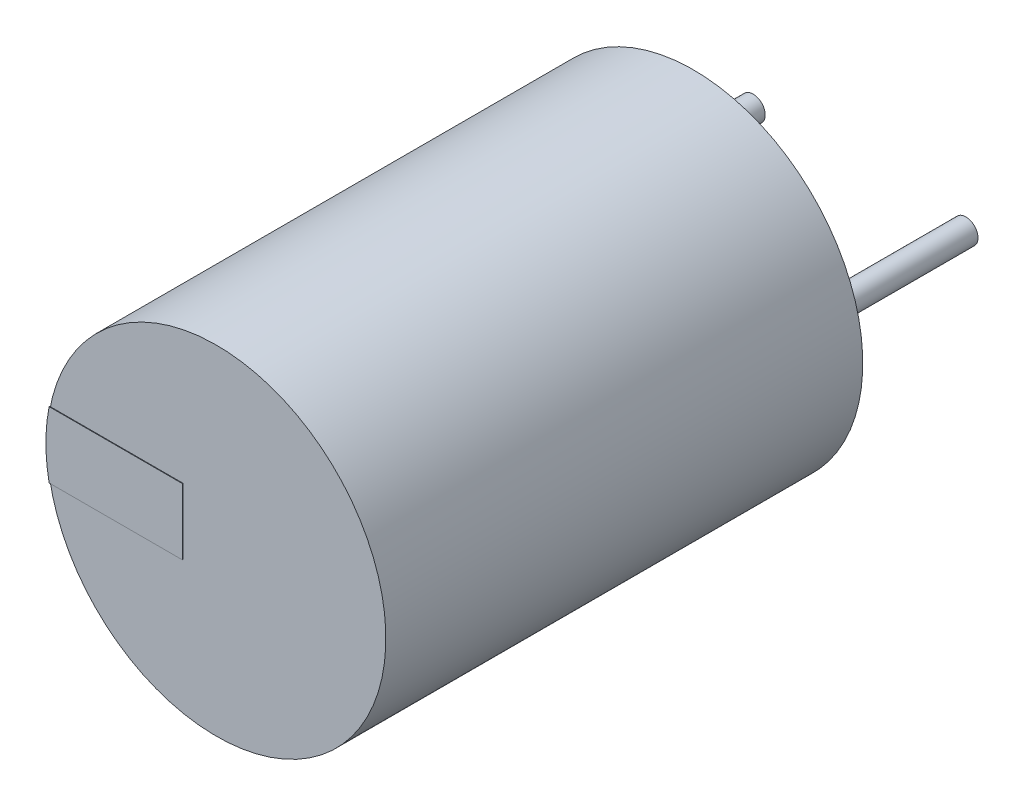
ISO-10303-21;
HEADER;
FILE_DESCRIPTION(('STEP AP214'),'2;1');
FILE_NAME('part.step','',(''),(''),'','','');
FILE_SCHEMA(('AUTOMOTIVE_DESIGN { 1 0 10303 214 1 1 1 1 }'));
ENDSEC;
DATA;
#1=APPLICATION_CONTEXT('core data for automotive mechanical design processes');
#2=APPLICATION_PROTOCOL_DEFINITION('international standard','automotive_design',2000,#1);
#3=PRODUCT_CONTEXT('',#1,'mechanical');
#4=PRODUCT('Part','Part','',(#3));
#5=PRODUCT_RELATED_PRODUCT_CATEGORY('part','',(#4));
#6=PRODUCT_DEFINITION_FORMATION('','',#4);
#7=PRODUCT_DEFINITION_CONTEXT('part definition',#1,'design');
#8=PRODUCT_DEFINITION('design','',#6,#7);
#9=PRODUCT_DEFINITION_SHAPE('','',#8);
#10=(LENGTH_UNIT() NAMED_UNIT(*) SI_UNIT(.MILLI.,.METRE.));
#11=(NAMED_UNIT(*) PLANE_ANGLE_UNIT() SI_UNIT($,.RADIAN.));
#12=(NAMED_UNIT(*) SI_UNIT($,.STERADIAN.) SOLID_ANGLE_UNIT());
#13=UNCERTAINTY_MEASURE_WITH_UNIT(LENGTH_MEASURE(1.E-05),#10,'distance_accuracy_value','');
#14=(GEOMETRIC_REPRESENTATION_CONTEXT(3) GLOBAL_UNCERTAINTY_ASSIGNED_CONTEXT((#13)) GLOBAL_UNIT_ASSIGNED_CONTEXT((#10,
#11,#12)) REPRESENTATION_CONTEXT('',''));
#15=CARTESIAN_POINT('',(0.,0.,0.));
#16=DIRECTION('',(0.,0.,1.));
#17=DIRECTION('',(1.,0.,0.));
#18=AXIS2_PLACEMENT_3D('',#15,#16,#17);
#19=CARTESIAN_POINT('',(5.791,0.,0.));
#20=DIRECTION('',(0.,0.,1.));
#21=DIRECTION('',(1.,0.,0.));
#22=AXIS2_PLACEMENT_3D('',#19,#20,#21);
#23=PLANE('',#22);
#24=CARTESIAN_POINT('',(5.791,0.,0.));
#25=DIRECTION('',(0.,0.,1.));
#26=DIRECTION('',(1.,0.,0.));
#27=AXIS2_PLACEMENT_3D('',#24,#25,#26);
#28=CIRCLE('',#27,0.3302);
#29=CARTESIAN_POINT('',(5.461,0.,0.));
#30=VERTEX_POINT('',#29);
#31=EDGE_CURVE('P0_E44',#30,#30,#28,.T.);
#32=ORIENTED_EDGE('',*,*,#31,.T.);
#33=EDGE_LOOP('',(#32));
#34=FACE_BOUND('',#33,.T.);
#35=ADVANCED_FACE('P0_F17',(#34),#23,.T.);
#36=CARTESIAN_POINT('',(5.791,0.,-4.521));
#37=DIRECTION('',(0.,0.,1.));
#38=DIRECTION('',(1.,0.,0.));
#39=AXIS2_PLACEMENT_3D('',#36,#37,#38);
#40=PLANE('',#39);
#41=CARTESIAN_POINT('',(5.791,0.,-4.521));
#42=DIRECTION('',(0.,0.,-1.));
#43=DIRECTION('',(1.,0.,0.));
#44=AXIS2_PLACEMENT_3D('',#41,#42,#43);
#45=CIRCLE('',#44,0.3302);
#46=CARTESIAN_POINT('',(5.461,0.,-4.521));
#47=VERTEX_POINT('',#46);
#48=EDGE_CURVE('P0_E11',#47,#47,#45,.T.);
#49=ORIENTED_EDGE('',*,*,#48,.T.);
#50=EDGE_LOOP('',(#49));
#51=FACE_BOUND('',#50,.T.);
#52=ADVANCED_FACE('P0_F75',(#51),#40,.F.);
#53=CARTESIAN_POINT('',(5.791,0.,-4.521));
#54=DIRECTION('',(0.,0.,1.));
#55=DIRECTION('',(1.,0.,0.));
#56=AXIS2_PLACEMENT_3D('',#53,#54,#55);
#57=CYLINDRICAL_SURFACE('',#56,0.3302);
#58=ORIENTED_EDGE('',*,*,#31,.F.);
#59=CARTESIAN_POINT('',(5.4608,0.,-4.521));
#60=CARTESIAN_POINT('',(5.4608,0.,0.));
#61=(BOUNDED_CURVE() B_SPLINE_CURVE(1,(#59,#60),.UNSPECIFIED.,.F.,
.F.) B_SPLINE_CURVE_WITH_KNOTS((2,2),(0.,4.521),
.UNSPECIFIED.) CURVE() GEOMETRIC_REPRESENTATION_ITEM() RATIONAL_B_SPLINE_CURVE((1.,1.)) REPRESENTATION_ITEM(''));
#62=EDGE_CURVE('P0_E27',#47,#30,#61,.T.);
#63=ORIENTED_EDGE('',*,*,#62,.F.);
#64=ORIENTED_EDGE('',*,*,#48,.F.);
#65=ORIENTED_EDGE('',*,*,#62,.T.);
#66=EDGE_LOOP('',(#58,#63,#64,#65));
#67=FACE_BOUND('',#66,.T.);
#68=ADVANCED_FACE('P0_F43',(#67),#57,.T.);
#69=CLOSED_SHELL('',(#35,#52,#68));
#70=MANIFOLD_SOLID_BREP('P0_B1',#69);
#71=CARTESIAN_POINT('',(0.,0.,0.));
#72=DIRECTION('',(0.,0.,1.));
#73=DIRECTION('',(1.,0.,0.));
#74=AXIS2_PLACEMENT_3D('',#71,#72,#73);
#75=PLANE('',#74);
#76=CARTESIAN_POINT('',(0.,0.,0.));
#77=DIRECTION('',(0.,0.,1.));
#78=DIRECTION('',(1.,0.,0.));
#79=AXIS2_PLACEMENT_3D('',#76,#77,#78);
#80=CIRCLE('',#79,0.3302);
#81=CARTESIAN_POINT('',(-0.33,0.,0.));
#82=VERTEX_POINT('',#81);
#83=EDGE_CURVE('P1_E44',#82,#82,#80,.T.);
#84=ORIENTED_EDGE('',*,*,#83,.T.);
#85=EDGE_LOOP('',(#84));
#86=FACE_BOUND('',#85,.T.);
#87=ADVANCED_FACE('P1_F17',(#86),#75,.T.);
#88=CARTESIAN_POINT('',(0.,0.,-4.521));
#89=DIRECTION('',(0.,0.,1.));
#90=DIRECTION('',(1.,0.,0.));
#91=AXIS2_PLACEMENT_3D('',#88,#89,#90);
#92=PLANE('',#91);
#93=CARTESIAN_POINT('',(0.,0.,-4.521));
#94=DIRECTION('',(0.,0.,-1.));
#95=DIRECTION('',(1.,0.,0.));
#96=AXIS2_PLACEMENT_3D('',#93,#94,#95);
#97=CIRCLE('',#96,0.3302);
#98=CARTESIAN_POINT('',(-0.33,0.,-4.521));
#99=VERTEX_POINT('',#98);
#100=EDGE_CURVE('P1_E11',#99,#99,#97,.T.);
#101=ORIENTED_EDGE('',*,*,#100,.T.);
#102=EDGE_LOOP('',(#101));
#103=FACE_BOUND('',#102,.T.);
#104=ADVANCED_FACE('P1_F75',(#103),#92,.F.);
#105=CARTESIAN_POINT('',(0.,0.,-4.521));
#106=DIRECTION('',(0.,0.,1.));
#107=DIRECTION('',(1.,0.,0.));
#108=AXIS2_PLACEMENT_3D('',#105,#106,#107);
#109=CYLINDRICAL_SURFACE('',#108,0.3302);
#110=ORIENTED_EDGE('',*,*,#83,.F.);
#111=CARTESIAN_POINT('',(-0.3302,0.,-4.521));
#112=CARTESIAN_POINT('',(-0.3302,0.,0.));
#113=(BOUNDED_CURVE() B_SPLINE_CURVE(1,(#111,#112),.UNSPECIFIED.,.F.,
.F.) B_SPLINE_CURVE_WITH_KNOTS((2,2),(0.,4.521),
.UNSPECIFIED.) CURVE() GEOMETRIC_REPRESENTATION_ITEM() RATIONAL_B_SPLINE_CURVE((1.,1.)) REPRESENTATION_ITEM(''));
#114=EDGE_CURVE('P1_E27',#99,#82,#113,.T.);
#115=ORIENTED_EDGE('',*,*,#114,.F.);
#116=ORIENTED_EDGE('',*,*,#100,.F.);
#117=ORIENTED_EDGE('',*,*,#114,.T.);
#118=EDGE_LOOP('',(#110,#115,#116,#117));
#119=FACE_BOUND('',#118,.T.);
#120=ADVANCED_FACE('P1_F19',(#119),#109,.T.);
#121=CLOSED_SHELL('',(#87,#104,#120));
#122=MANIFOLD_SOLID_BREP('P1_B1',#121);
#123=CARTESIAN_POINT('',(2.896,0.,12.979));
#124=DIRECTION('',(0.,0.,1.));
#125=DIRECTION('',(1.,0.,0.));
#126=AXIS2_PLACEMENT_3D('',#123,#124,#125);
#127=PLANE('',#126);
#128=CARTESIAN_POINT('',(2.896,0.,12.979));
#129=DIRECTION('',(0.,0.,1.));
#130=DIRECTION('',(1.,0.,0.));
#131=AXIS2_PLACEMENT_3D('',#128,#129,#130);
#132=CIRCLE('',#131,4.6101);
#133=CARTESIAN_POINT('',(-1.714,0.,12.979));
#134=VERTEX_POINT('',#133);
#135=EDGE_CURVE('P2_E45',#134,#134,#132,.T.);
#136=ORIENTED_EDGE('',*,*,#135,.T.);
#137=EDGE_LOOP('',(#136));
#138=FACE_BOUND('',#137,.T.);
#139=ADVANCED_FACE('P2_F17',(#138),#127,.T.);
#140=CARTESIAN_POINT('',(2.896,0.,0.));
#141=DIRECTION('',(0.,0.,1.));
#142=DIRECTION('',(1.,0.,0.));
#143=AXIS2_PLACEMENT_3D('',#140,#141,#142);
#144=PLANE('',#143);
#145=CARTESIAN_POINT('',(2.896,0.,0.));
#146=DIRECTION('',(0.,0.,-1.));
#147=DIRECTION('',(1.,0.,0.));
#148=AXIS2_PLACEMENT_3D('',#145,#146,#147);
#149=CIRCLE('',#148,4.6101);
#150=CARTESIAN_POINT('',(-1.714,0.,0.));
#151=VERTEX_POINT('',#150);
#152=EDGE_CURVE('P2_E11',#151,#151,#149,.T.);
#153=ORIENTED_EDGE('',*,*,#152,.T.);
#154=EDGE_LOOP('',(#153));
#155=FACE_BOUND('',#154,.T.);
#156=ADVANCED_FACE('P2_F19',(#155),#144,.F.);
#157=CARTESIAN_POINT('',(2.896,0.,0.));
#158=DIRECTION('',(0.,0.,1.));
#159=DIRECTION('',(1.,0.,0.));
#160=AXIS2_PLACEMENT_3D('',#157,#158,#159);
#161=CYLINDRICAL_SURFACE('',#160,4.6101);
#162=ORIENTED_EDGE('',*,*,#135,.F.);
#163=CARTESIAN_POINT('',(-1.7141,0.,0.));
#164=CARTESIAN_POINT('',(-1.7141,0.,12.979));
#165=(BOUNDED_CURVE() B_SPLINE_CURVE(1,(#163,#164),.UNSPECIFIED.,.F.,
.F.) B_SPLINE_CURVE_WITH_KNOTS((2,2),(0.,12.979),
.UNSPECIFIED.) CURVE() GEOMETRIC_REPRESENTATION_ITEM() RATIONAL_B_SPLINE_CURVE((1.,1.)) REPRESENTATION_ITEM(''));
#166=EDGE_CURVE('P2_E28',#151,#134,#165,.T.);
#167=ORIENTED_EDGE('',*,*,#166,.F.);
#168=ORIENTED_EDGE('',*,*,#152,.F.);
#169=ORIENTED_EDGE('',*,*,#166,.T.);
#170=EDGE_LOOP('',(#162,#167,#168,#169));
#171=FACE_BOUND('',#170,.T.);
#172=ADVANCED_FACE('P2_F44',(#171),#161,.T.);
#173=CLOSED_SHELL('',(#139,#156,#172));
#174=MANIFOLD_SOLID_BREP('P2_B1',#173);
#175=CARTESIAN_POINT('',(1.983,-0.899,12.995));
#176=DIRECTION('',(0.,0.,1.));
#177=DIRECTION('',(1.,0.,0.));
#178=AXIS2_PLACEMENT_3D('',#175,#176,#177);
#179=PLANE('',#178);
#180=DIRECTION('',(1.,0.,0.));
#181=VECTOR('',#180,1.);
#182=CARTESIAN_POINT('',(-1.642,-0.899,12.995));
#183=LINE('',#182,#181);
#184=CARTESIAN_POINT('',(-1.642,-0.899,12.995));
#185=VERTEX_POINT('',#184);
#186=CARTESIAN_POINT('',(1.983,-0.899,12.995));
#187=VERTEX_POINT('',#186);
#188=EDGE_CURVE('P3_E131',#185,#187,#183,.T.);
#189=ORIENTED_EDGE('',*,*,#188,.T.);
#190=DIRECTION('',(0.,1.,0.));
#191=VECTOR('',#190,1.);
#192=CARTESIAN_POINT('',(1.983,-0.899,12.995));
#193=LINE('',#192,#191);
#194=CARTESIAN_POINT('',(1.983,0.899,12.995));
#195=VERTEX_POINT('',#194);
#196=EDGE_CURVE('P3_E147',#187,#195,#193,.T.);
#197=ORIENTED_EDGE('',*,*,#196,.T.);
#198=DIRECTION('',(-1.,0.,0.));
#199=VECTOR('',#198,1.);
#200=CARTESIAN_POINT('',(1.983,0.899,12.995));
#201=LINE('',#200,#199);
#202=CARTESIAN_POINT('',(-1.642,0.899,12.995));
#203=VERTEX_POINT('',#202);
#204=EDGE_CURVE('P3_E138',#195,#203,#201,.T.);
#205=ORIENTED_EDGE('',*,*,#204,.T.);
#206=CARTESIAN_POINT('',(2.905,0.,12.995));
#207=DIRECTION('',(0.,0.,1.));
#208=DIRECTION('',(1.,0.,0.));
#209=AXIS2_PLACEMENT_3D('',#206,#207,#208);
#210=CIRCLE('',#209,4.6355);
#211=EDGE_CURVE('P3_E93',#203,#185,#210,.T.);
#212=ORIENTED_EDGE('',*,*,#211,.T.);
#213=EDGE_LOOP('',(#189,#197,#205,#212));
#214=FACE_BOUND('',#213,.T.);
#215=ADVANCED_FACE('P3_F16',(#214),#179,.T.);
#216=CARTESIAN_POINT('',(1.983,0.899,12.97));
#217=DIRECTION('',(0.,0.,-1.));
#218=DIRECTION('',(0.,-1.,0.));
#219=AXIS2_PLACEMENT_3D('',#216,#217,#218);
#220=PLANE('',#219);
#221=DIRECTION('',(1.,0.,0.));
#222=VECTOR('',#221,1.);
#223=CARTESIAN_POINT('',(-1.616,0.899,12.97));
#224=LINE('',#223,#222);
#225=CARTESIAN_POINT('',(-1.616,0.899,12.97));
#226=VERTEX_POINT('',#225);
#227=CARTESIAN_POINT('',(1.983,0.899,12.97));
#228=VERTEX_POINT('',#227);
#229=EDGE_CURVE('P3_E186',#226,#228,#224,.T.);
#230=ORIENTED_EDGE('',*,*,#229,.T.);
#231=DIRECTION('',(0.,-1.,0.));
#232=VECTOR('',#231,1.);
#233=CARTESIAN_POINT('',(1.983,0.899,12.97));
#234=LINE('',#233,#232);
#235=CARTESIAN_POINT('',(1.983,-0.899,12.97));
#236=VERTEX_POINT('',#235);
#237=EDGE_CURVE('P3_E188',#228,#236,#234,.T.);
#238=ORIENTED_EDGE('',*,*,#237,.T.);
#239=DIRECTION('',(-1.,0.,0.));
#240=VECTOR('',#239,1.);
#241=CARTESIAN_POINT('',(1.983,-0.899,12.97));
#242=LINE('',#241,#240);
#243=CARTESIAN_POINT('',(-1.616,-0.899,12.97));
#244=VERTEX_POINT('',#243);
#245=EDGE_CURVE('P3_E102',#236,#244,#242,.T.);
#246=ORIENTED_EDGE('',*,*,#245,.T.);
#247=CARTESIAN_POINT('',(2.905,0.,12.97));
#248=DIRECTION('',(0.,0.,-1.));
#249=DIRECTION('',(-1.,0.,0.));
#250=AXIS2_PLACEMENT_3D('',#247,#248,#249);
#251=CIRCLE('',#250,4.6101);
#252=EDGE_CURVE('P3_E10',#244,#226,#251,.T.);
#253=ORIENTED_EDGE('',*,*,#252,.T.);
#254=EDGE_LOOP('',(#230,#238,#246,#253));
#255=FACE_BOUND('',#254,.T.);
#256=ADVANCED_FACE('P3_F178',(#255),#220,.T.);
#257=CARTESIAN_POINT('',(-1.642,-0.899,2.586));
#258=DIRECTION('',(0.,0.,-1.));
#259=DIRECTION('',(0.,-1.,0.));
#260=AXIS2_PLACEMENT_3D('',#257,#258,#259);
#261=PLANE('',#260);
#262=DIRECTION('',(-1.,0.,0.));
#263=VECTOR('',#262,1.);
#264=CARTESIAN_POINT('',(-1.616,-0.899,2.586));
#265=LINE('',#264,#263);
#266=CARTESIAN_POINT('',(-1.616,-0.899,2.586));
#267=VERTEX_POINT('',#266);
#268=CARTESIAN_POINT('',(-1.642,-0.899,2.586));
#269=VERTEX_POINT('',#268);
#270=EDGE_CURVE('P3_E87',#267,#269,#265,.T.);
#271=ORIENTED_EDGE('',*,*,#270,.T.);
#272=CARTESIAN_POINT('',(2.905,0.,2.586));
#273=DIRECTION('',(0.,0.,-1.));
#274=DIRECTION('',(-1.,0.,0.));
#275=AXIS2_PLACEMENT_3D('',#272,#273,#274);
#276=CIRCLE('',#275,4.6355);
#277=CARTESIAN_POINT('',(-1.642,0.899,2.586));
#278=VERTEX_POINT('',#277);
#279=EDGE_CURVE('P3_E128',#269,#278,#276,.T.);
#280=ORIENTED_EDGE('',*,*,#279,.T.);
#281=DIRECTION('',(1.,0.,0.));
#282=VECTOR('',#281,1.);
#283=CARTESIAN_POINT('',(-1.642,0.899,2.586));
#284=LINE('',#283,#282);
#285=CARTESIAN_POINT('',(-1.616,0.899,2.586));
#286=VERTEX_POINT('',#285);
#287=EDGE_CURVE('P3_E89',#278,#286,#284,.T.);
#288=ORIENTED_EDGE('',*,*,#287,.T.);
#289=CARTESIAN_POINT('',(2.905,0.,2.586));
#290=DIRECTION('',(0.,0.,1.));
#291=DIRECTION('',(1.,0.,0.));
#292=AXIS2_PLACEMENT_3D('',#289,#290,#291);
#293=CIRCLE('',#292,4.6101);
#294=EDGE_CURVE('P3_E30',#286,#267,#293,.T.);
#295=ORIENTED_EDGE('',*,*,#294,.T.);
#296=EDGE_LOOP('',(#271,#280,#288,#295));
#297=FACE_BOUND('',#296,.T.);
#298=ADVANCED_FACE('P3_F84',(#297),#261,.T.);
#299=CARTESIAN_POINT('',(2.905,0.,2.586));
#300=DIRECTION('',(0.,0.,1.));
#301=DIRECTION('',(-1.,0.,0.));
#302=AXIS2_PLACEMENT_3D('',#299,#300,#301);
#303=CYLINDRICAL_SURFACE('',#302,4.6101);
#304=CARTESIAN_POINT('',(-1.61657233376124,-0.899113808460818,12.97));
#305=DIRECTION('',(0.,0.,-1.));
#306=VECTOR('',#305,1.);
#307=LINE('',#304,#306);
#308=EDGE_CURVE('P3_E96',#244,#267,#307,.T.);
#309=ORIENTED_EDGE('',*,*,#308,.T.);
#310=ORIENTED_EDGE('',*,*,#294,.F.);
#311=CARTESIAN_POINT('',(-1.61657233376124,0.899113808460805,2.586));
#312=DIRECTION('',(0.,0.,1.));
#313=VECTOR('',#312,1.);
#314=LINE('',#311,#313);
#315=EDGE_CURVE('P3_E151',#286,#226,#314,.T.);
#316=ORIENTED_EDGE('',*,*,#315,.T.);
#317=ORIENTED_EDGE('',*,*,#252,.F.);
#318=EDGE_LOOP('',(#309,#310,#316,#317));
#319=FACE_BOUND('',#318,.T.);
#320=ADVANCED_FACE('P3_F98',(#319),#303,.F.);
#321=CARTESIAN_POINT('',(2.905,0.,2.586));
#322=DIRECTION('',(0.,0.,1.));
#323=DIRECTION('',(-1.,0.,0.));
#324=AXIS2_PLACEMENT_3D('',#321,#322,#323);
#325=CYLINDRICAL_SURFACE('',#324,4.6355);
#326=CARTESIAN_POINT('',(-1.64247092707658,0.899093108300384,12.995));
#327=DIRECTION('',(0.,0.,-1.));
#328=VECTOR('',#327,1.);
#329=LINE('',#326,#328);
#330=EDGE_CURVE('P3_E123',#203,#278,#329,.T.);
#331=ORIENTED_EDGE('',*,*,#330,.T.);
#332=ORIENTED_EDGE('',*,*,#279,.F.);
#333=CARTESIAN_POINT('',(-1.64247092707658,-0.899093108300384,2.586));
#334=DIRECTION('',(0.,0.,1.));
#335=VECTOR('',#334,1.);
#336=LINE('',#333,#335);
#337=EDGE_CURVE('P3_E109',#269,#185,#336,.T.);
#338=ORIENTED_EDGE('',*,*,#337,.T.);
#339=ORIENTED_EDGE('',*,*,#211,.F.);
#340=EDGE_LOOP('',(#331,#332,#338,#339));
#341=FACE_BOUND('',#340,.T.);
#342=ADVANCED_FACE('P3_F18',(#341),#325,.T.);
#343=CARTESIAN_POINT('',(1.983,-0.899,12.97));
#344=DIRECTION('',(1.,0.,0.));
#345=DIRECTION('',(0.,1.,0.));
#346=AXIS2_PLACEMENT_3D('',#343,#344,#345);
#347=PLANE('',#346);
#348=ORIENTED_EDGE('',*,*,#237,.F.);
#349=DIRECTION('',(0.,0.,1.));
#350=VECTOR('',#349,1.);
#351=CARTESIAN_POINT('',(1.983,0.899,12.97));
#352=LINE('',#351,#350);
#353=EDGE_CURVE('P3_E142',#228,#195,#352,.T.);
#354=ORIENTED_EDGE('',*,*,#353,.T.);
#355=ORIENTED_EDGE('',*,*,#196,.F.);
#356=DIRECTION('',(0.,0.,-1.));
#357=VECTOR('',#356,1.);
#358=CARTESIAN_POINT('',(1.983,-0.899,12.995));
#359=LINE('',#358,#357);
#360=EDGE_CURVE('P3_E135',#187,#236,#359,.T.);
#361=ORIENTED_EDGE('',*,*,#360,.T.);
#362=EDGE_LOOP('',(#348,#354,#355,#361));
#363=FACE_BOUND('',#362,.T.);
#364=ADVANCED_FACE('P3_F167',(#363),#347,.T.);
#365=CARTESIAN_POINT('',(-1.616,0.899,2.586));
#366=DIRECTION('',(0.,1.,0.));
#367=DIRECTION('',(1.,0.,0.));
#368=AXIS2_PLACEMENT_3D('',#365,#366,#367);
#369=PLANE('',#368);
#370=ORIENTED_EDGE('',*,*,#287,.F.);
#371=ORIENTED_EDGE('',*,*,#330,.F.);
#372=ORIENTED_EDGE('',*,*,#204,.F.);
#373=ORIENTED_EDGE('',*,*,#353,.F.);
#374=ORIENTED_EDGE('',*,*,#229,.F.);
#375=ORIENTED_EDGE('',*,*,#315,.F.);
#376=EDGE_LOOP('',(#370,#371,#372,#373,#374,#375));
#377=FACE_BOUND('',#376,.T.);
#378=ADVANCED_FACE('P3_F195',(#377),#369,.T.);
#379=CARTESIAN_POINT('',(-1.642,-0.899,2.586));
#380=DIRECTION('',(0.,-1.,0.));
#381=DIRECTION('',(0.,0.,-1.));
#382=AXIS2_PLACEMENT_3D('',#379,#380,#381);
#383=PLANE('',#382);
#384=ORIENTED_EDGE('',*,*,#270,.F.);
#385=ORIENTED_EDGE('',*,*,#308,.F.);
#386=ORIENTED_EDGE('',*,*,#245,.F.);
#387=ORIENTED_EDGE('',*,*,#360,.F.);
#388=ORIENTED_EDGE('',*,*,#188,.F.);
#389=ORIENTED_EDGE('',*,*,#337,.F.);
#390=EDGE_LOOP('',(#384,#385,#386,#387,#388,#389));
#391=FACE_BOUND('',#390,.T.);
#392=ADVANCED_FACE('P3_F106',(#391),#383,.T.);
#393=CLOSED_SHELL('',(#215,#256,#298,#320,#342,#364,#378,#392));
#394=MANIFOLD_SOLID_BREP('P3_B1',#393);
#395=ADVANCED_BREP_SHAPE_REPRESENTATION('',(#18,#70,#122,#174,#394),#14);
#396=SHAPE_DEFINITION_REPRESENTATION(#9,#395);
ENDSEC;
END-ISO-10303-21;
